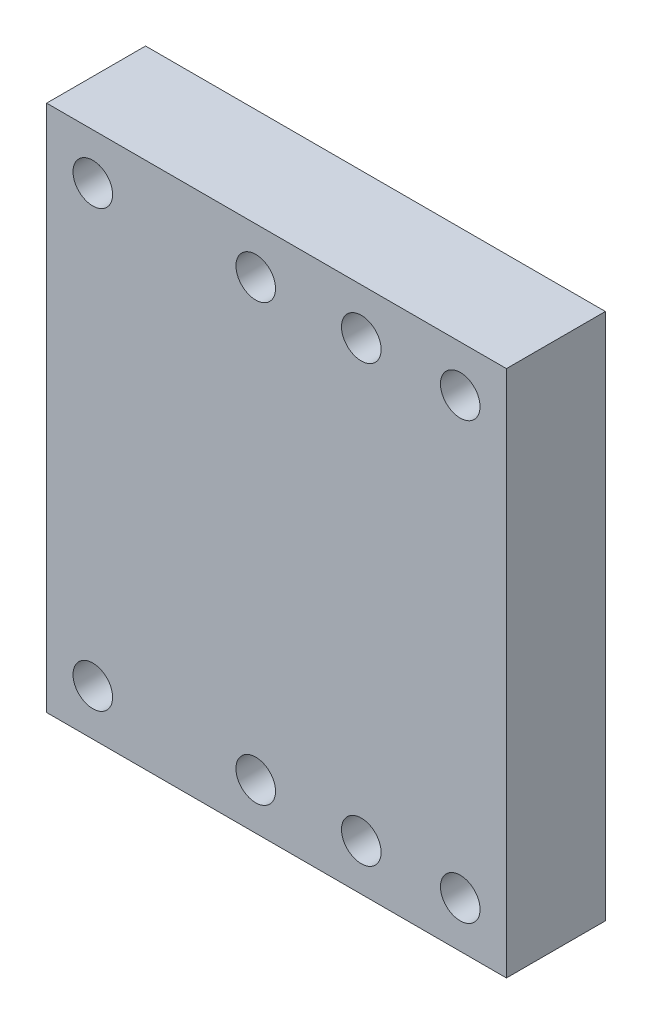
ISO-10303-21;
HEADER;
FILE_DESCRIPTION(('STEP AP214'),'2;1');
FILE_NAME('part.step','',(''),(''),'','','');
FILE_SCHEMA(('AUTOMOTIVE_DESIGN { 1 0 10303 214 1 1 1 1 }'));
ENDSEC;
DATA;
#1=APPLICATION_CONTEXT('core data for automotive mechanical design processes');
#2=APPLICATION_PROTOCOL_DEFINITION('international standard','automotive_design',2000,#1);
#3=PRODUCT_CONTEXT('',#1,'mechanical');
#4=PRODUCT('Part','Part','',(#3));
#5=PRODUCT_RELATED_PRODUCT_CATEGORY('part','',(#4));
#6=PRODUCT_DEFINITION_FORMATION('','',#4);
#7=PRODUCT_DEFINITION_CONTEXT('part definition',#1,'design');
#8=PRODUCT_DEFINITION('design','',#6,#7);
#9=PRODUCT_DEFINITION_SHAPE('','',#8);
#10=(LENGTH_UNIT() NAMED_UNIT(*) SI_UNIT(.MILLI.,.METRE.));
#11=(NAMED_UNIT(*) PLANE_ANGLE_UNIT() SI_UNIT($,.RADIAN.));
#12=(NAMED_UNIT(*) SI_UNIT($,.STERADIAN.) SOLID_ANGLE_UNIT());
#13=UNCERTAINTY_MEASURE_WITH_UNIT(LENGTH_MEASURE(1.E-05),#10,'distance_accuracy_value','');
#14=(GEOMETRIC_REPRESENTATION_CONTEXT(3) GLOBAL_UNCERTAINTY_ASSIGNED_CONTEXT((#13)) GLOBAL_UNIT_ASSIGNED_CONTEXT((#10,
#11,#12)) REPRESENTATION_CONTEXT('',''));
#15=CARTESIAN_POINT('',(0.,0.,0.));
#16=DIRECTION('',(0.,0.,1.));
#17=DIRECTION('',(1.,0.,0.));
#18=AXIS2_PLACEMENT_3D('',#15,#16,#17);
#19=CARTESIAN_POINT('',(-34.85,40.,15.));
#20=DIRECTION('',(1.,0.,0.));
#21=DIRECTION('',(0.,1.,0.));
#22=AXIS2_PLACEMENT_3D('',#19,#20,#21);
#23=PLANE('',#22);
#24=DIRECTION('',(0.,-1.,0.));
#25=VECTOR('',#24,1.);
#26=CARTESIAN_POINT('',(-34.85,40.,0.));
#27=LINE('',#26,#25);
#28=CARTESIAN_POINT('',(-34.85,40.,0.));
#29=VERTEX_POINT('',#28);
#30=CARTESIAN_POINT('',(-34.85,-40.,0.));
#31=VERTEX_POINT('',#30);
#32=EDGE_CURVE('E101',#29,#31,#27,.T.);
#33=ORIENTED_EDGE('',*,*,#32,.T.);
#34=DIRECTION('',(0.,0.,-1.));
#35=VECTOR('',#34,1.);
#36=CARTESIAN_POINT('',(-34.85,-40.,15.));
#37=LINE('',#36,#35);
#38=CARTESIAN_POINT('',(-34.85,-40.,15.));
#39=VERTEX_POINT('',#38);
#40=EDGE_CURVE('E11',#39,#31,#37,.T.);
#41=ORIENTED_EDGE('',*,*,#40,.F.);
#42=DIRECTION('',(0.,-1.,0.));
#43=VECTOR('',#42,1.);
#44=CARTESIAN_POINT('',(-34.85,40.,15.));
#45=LINE('',#44,#43);
#46=CARTESIAN_POINT('',(-34.85,40.,15.));
#47=VERTEX_POINT('',#46);
#48=EDGE_CURVE('E88',#47,#39,#45,.T.);
#49=ORIENTED_EDGE('',*,*,#48,.F.);
#50=DIRECTION('',(0.,0.,-1.));
#51=VECTOR('',#50,1.);
#52=CARTESIAN_POINT('',(-34.85,40.,15.));
#53=LINE('',#52,#51);
#54=EDGE_CURVE('E97',#47,#29,#53,.T.);
#55=ORIENTED_EDGE('',*,*,#54,.T.);
#56=EDGE_LOOP('',(#33,#41,#49,#55));
#57=FACE_BOUND('',#56,.T.);
#58=ADVANCED_FACE('F35',(#57),#23,.F.);
#59=CARTESIAN_POINT('',(-34.85,-40.,15.));
#60=DIRECTION('',(0.,1.,0.));
#61=DIRECTION('',(0.,0.,1.));
#62=AXIS2_PLACEMENT_3D('',#59,#60,#61);
#63=PLANE('',#62);
#64=DIRECTION('',(1.,0.,0.));
#65=VECTOR('',#64,1.);
#66=CARTESIAN_POINT('',(-34.85,-40.,0.));
#67=LINE('',#66,#65);
#68=CARTESIAN_POINT('',(34.85,-40.,0.));
#69=VERTEX_POINT('',#68);
#70=EDGE_CURVE('E92',#31,#69,#67,.T.);
#71=ORIENTED_EDGE('',*,*,#70,.T.);
#72=DIRECTION('',(0.,0.,-1.));
#73=VECTOR('',#72,1.);
#74=CARTESIAN_POINT('',(34.85,-40.,15.));
#75=LINE('',#74,#73);
#76=CARTESIAN_POINT('',(34.85,-40.,15.));
#77=VERTEX_POINT('',#76);
#78=EDGE_CURVE('E44',#77,#69,#75,.T.);
#79=ORIENTED_EDGE('',*,*,#78,.F.);
#80=DIRECTION('',(1.,0.,0.));
#81=VECTOR('',#80,1.);
#82=CARTESIAN_POINT('',(-34.85,-40.,15.));
#83=LINE('',#82,#81);
#84=EDGE_CURVE('E83',#39,#77,#83,.T.);
#85=ORIENTED_EDGE('',*,*,#84,.F.);
#86=ORIENTED_EDGE('',*,*,#40,.T.);
#87=EDGE_LOOP('',(#71,#79,#85,#86));
#88=FACE_BOUND('',#87,.T.);
#89=ADVANCED_FACE('F91',(#88),#63,.F.);
#90=CARTESIAN_POINT('',(34.85,-40.,15.));
#91=DIRECTION('',(-1.,0.,0.));
#92=DIRECTION('',(0.,-1.,0.));
#93=AXIS2_PLACEMENT_3D('',#90,#91,#92);
#94=PLANE('',#93);
#95=DIRECTION('',(0.,1.,0.));
#96=VECTOR('',#95,1.);
#97=CARTESIAN_POINT('',(34.85,-40.,0.));
#98=LINE('',#97,#96);
#99=CARTESIAN_POINT('',(34.85,40.,0.));
#100=VERTEX_POINT('',#99);
#101=EDGE_CURVE('E70',#69,#100,#98,.T.);
#102=ORIENTED_EDGE('',*,*,#101,.T.);
#103=DIRECTION('',(0.,0.,-1.));
#104=VECTOR('',#103,1.);
#105=CARTESIAN_POINT('',(34.85,40.,15.));
#106=LINE('',#105,#104);
#107=CARTESIAN_POINT('',(34.85,40.,15.));
#108=VERTEX_POINT('',#107);
#109=EDGE_CURVE('E93',#108,#100,#106,.T.);
#110=ORIENTED_EDGE('',*,*,#109,.F.);
#111=DIRECTION('',(0.,1.,0.));
#112=VECTOR('',#111,1.);
#113=CARTESIAN_POINT('',(34.85,-40.,15.));
#114=LINE('',#113,#112);
#115=EDGE_CURVE('E86',#77,#108,#114,.T.);
#116=ORIENTED_EDGE('',*,*,#115,.F.);
#117=ORIENTED_EDGE('',*,*,#78,.T.);
#118=EDGE_LOOP('',(#102,#110,#116,#117));
#119=FACE_BOUND('',#118,.T.);
#120=ADVANCED_FACE('F95',(#119),#94,.F.);
#121=CARTESIAN_POINT('',(34.85,40.,15.));
#122=DIRECTION('',(0.,-1.,0.));
#123=DIRECTION('',(1.,0.,0.));
#124=AXIS2_PLACEMENT_3D('',#121,#122,#123);
#125=PLANE('',#124);
#126=DIRECTION('',(-1.,0.,0.));
#127=VECTOR('',#126,1.);
#128=CARTESIAN_POINT('',(34.85,40.,0.));
#129=LINE('',#128,#127);
#130=EDGE_CURVE('E76',#100,#29,#129,.T.);
#131=ORIENTED_EDGE('',*,*,#130,.T.);
#132=ORIENTED_EDGE('',*,*,#54,.F.);
#133=DIRECTION('',(-1.,0.,0.));
#134=VECTOR('',#133,1.);
#135=CARTESIAN_POINT('',(34.85,40.,15.));
#136=LINE('',#135,#134);
#137=EDGE_CURVE('E53',#108,#47,#136,.T.);
#138=ORIENTED_EDGE('',*,*,#137,.F.);
#139=ORIENTED_EDGE('',*,*,#109,.T.);
#140=EDGE_LOOP('',(#131,#132,#138,#139));
#141=FACE_BOUND('',#140,.T.);
#142=ADVANCED_FACE('F202',(#141),#125,.F.);
#143=CARTESIAN_POINT('',(0.,0.,15.));
#144=DIRECTION('',(0.,0.,1.));
#145=DIRECTION('',(1.,0.,0.));
#146=AXIS2_PLACEMENT_3D('',#143,#144,#145);
#147=PLANE('',#146);
#148=CARTESIAN_POINT('',(-27.85,-33.,15.));
#149=DIRECTION('',(0.,0.,1.));
#150=DIRECTION('',(1.,0.,0.));
#151=AXIS2_PLACEMENT_3D('',#148,#149,#150);
#152=CIRCLE('',#151,3.);
#153=CARTESIAN_POINT('',(-24.85,-33.,15.));
#154=VERTEX_POINT('',#153);
#155=EDGE_CURVE('E171',#154,#154,#152,.T.);
#156=ORIENTED_EDGE('',*,*,#155,.F.);
#157=EDGE_LOOP('',(#156));
#158=FACE_BOUND('',#157,.T.);
#159=CARTESIAN_POINT('',(27.85,-33.,15.));
#160=DIRECTION('',(0.,0.,1.));
#161=DIRECTION('',(1.,0.,0.));
#162=AXIS2_PLACEMENT_3D('',#159,#160,#161);
#163=CIRCLE('',#162,3.);
#164=CARTESIAN_POINT('',(30.85,-33.,15.));
#165=VERTEX_POINT('',#164);
#166=EDGE_CURVE('E177',#165,#165,#163,.T.);
#167=ORIENTED_EDGE('',*,*,#166,.F.);
#168=EDGE_LOOP('',(#167));
#169=FACE_BOUND('',#168,.T.);
#170=CARTESIAN_POINT('',(27.85,33.,15.));
#171=DIRECTION('',(0.,0.,1.));
#172=DIRECTION('',(1.,0.,0.));
#173=AXIS2_PLACEMENT_3D('',#170,#171,#172);
#174=CIRCLE('',#173,3.);
#175=CARTESIAN_POINT('',(30.85,33.,15.));
#176=VERTEX_POINT('',#175);
#177=EDGE_CURVE('E183',#176,#176,#174,.T.);
#178=ORIENTED_EDGE('',*,*,#177,.F.);
#179=EDGE_LOOP('',(#178));
#180=FACE_BOUND('',#179,.T.);
#181=CARTESIAN_POINT('',(-27.85,33.,15.));
#182=DIRECTION('',(0.,0.,1.));
#183=DIRECTION('',(1.,0.,0.));
#184=AXIS2_PLACEMENT_3D('',#181,#182,#183);
#185=CIRCLE('',#184,3.);
#186=CARTESIAN_POINT('',(-24.85,33.,15.));
#187=VERTEX_POINT('',#186);
#188=EDGE_CURVE('E165',#187,#187,#185,.T.);
#189=ORIENTED_EDGE('',*,*,#188,.F.);
#190=EDGE_LOOP('',(#189));
#191=FACE_BOUND('',#190,.T.);
#192=CARTESIAN_POINT('',(12.85,33.,15.));
#193=DIRECTION('',(0.,0.,-1.));
#194=DIRECTION('',(-1.,0.,0.));
#195=AXIS2_PLACEMENT_3D('',#192,#193,#194);
#196=CIRCLE('',#195,2.99999999999999);
#197=CARTESIAN_POINT('',(9.85,33.,15.));
#198=VERTEX_POINT('',#197);
#199=EDGE_CURVE('E121',#198,#198,#196,.T.);
#200=ORIENTED_EDGE('',*,*,#199,.T.);
#201=EDGE_LOOP('',(#200));
#202=FACE_BOUND('',#201,.T.);
#203=CARTESIAN_POINT('',(-3.15000000000001,33.,15.));
#204=DIRECTION('',(0.,0.,-1.));
#205=DIRECTION('',(-1.,0.,0.));
#206=AXIS2_PLACEMENT_3D('',#203,#204,#205);
#207=CIRCLE('',#206,2.99999999999999);
#208=CARTESIAN_POINT('',(-6.15,33.,15.));
#209=VERTEX_POINT('',#208);
#210=EDGE_CURVE('E125',#209,#209,#207,.T.);
#211=ORIENTED_EDGE('',*,*,#210,.T.);
#212=EDGE_LOOP('',(#211));
#213=FACE_BOUND('',#212,.T.);
#214=CARTESIAN_POINT('',(-3.15000000000001,-33.,15.));
#215=DIRECTION('',(0.,0.,-1.));
#216=DIRECTION('',(-1.,0.,0.));
#217=AXIS2_PLACEMENT_3D('',#214,#215,#216);
#218=CIRCLE('',#217,3.00000000000001);
#219=CARTESIAN_POINT('',(-6.15000000000003,-33.,15.));
#220=VERTEX_POINT('',#219);
#221=EDGE_CURVE('E130',#220,#220,#218,.T.);
#222=ORIENTED_EDGE('',*,*,#221,.T.);
#223=EDGE_LOOP('',(#222));
#224=FACE_BOUND('',#223,.T.);
#225=CARTESIAN_POINT('',(12.85,-33.,15.));
#226=DIRECTION('',(0.,0.,-1.));
#227=DIRECTION('',(-1.,0.,0.));
#228=AXIS2_PLACEMENT_3D('',#225,#226,#227);
#229=CIRCLE('',#228,3.);
#230=CARTESIAN_POINT('',(9.84999999999998,-33.,15.));
#231=VERTEX_POINT('',#230);
#232=EDGE_CURVE('E104',#231,#231,#229,.T.);
#233=ORIENTED_EDGE('',*,*,#232,.T.);
#234=EDGE_LOOP('',(#233));
#235=FACE_BOUND('',#234,.T.);
#236=ORIENTED_EDGE('',*,*,#48,.T.);
#237=ORIENTED_EDGE('',*,*,#84,.T.);
#238=ORIENTED_EDGE('',*,*,#115,.T.);
#239=ORIENTED_EDGE('',*,*,#137,.T.);
#240=EDGE_LOOP('',(#236,#237,#238,#239));
#241=FACE_BOUND('',#240,.T.);
#242=ADVANCED_FACE('F84',(#158,#169,#180,#191,#202,#213,#224,#235,#241),#147,.T.);
#243=CARTESIAN_POINT('',(0.,0.,0.));
#244=DIRECTION('',(0.,0.,1.));
#245=DIRECTION('',(1.,0.,0.));
#246=AXIS2_PLACEMENT_3D('',#243,#244,#245);
#247=PLANE('',#246);
#248=CARTESIAN_POINT('',(-27.85,-33.,0.));
#249=DIRECTION('',(0.,0.,1.));
#250=DIRECTION('',(1.,0.,0.));
#251=AXIS2_PLACEMENT_3D('',#248,#249,#250);
#252=CIRCLE('',#251,3.);
#253=CARTESIAN_POINT('',(-24.85,-33.,0.));
#254=VERTEX_POINT('',#253);
#255=EDGE_CURVE('E174',#254,#254,#252,.T.);
#256=ORIENTED_EDGE('',*,*,#255,.T.);
#257=EDGE_LOOP('',(#256));
#258=FACE_BOUND('',#257,.T.);
#259=CARTESIAN_POINT('',(27.85,-33.,0.));
#260=DIRECTION('',(0.,0.,1.));
#261=DIRECTION('',(1.,0.,0.));
#262=AXIS2_PLACEMENT_3D('',#259,#260,#261);
#263=CIRCLE('',#262,3.);
#264=CARTESIAN_POINT('',(30.85,-33.,0.));
#265=VERTEX_POINT('',#264);
#266=EDGE_CURVE('E180',#265,#265,#263,.T.);
#267=ORIENTED_EDGE('',*,*,#266,.T.);
#268=EDGE_LOOP('',(#267));
#269=FACE_BOUND('',#268,.T.);
#270=CARTESIAN_POINT('',(27.85,33.,0.));
#271=DIRECTION('',(0.,0.,1.));
#272=DIRECTION('',(1.,0.,0.));
#273=AXIS2_PLACEMENT_3D('',#270,#271,#272);
#274=CIRCLE('',#273,3.);
#275=CARTESIAN_POINT('',(30.85,33.,0.));
#276=VERTEX_POINT('',#275);
#277=EDGE_CURVE('E168',#276,#276,#274,.T.);
#278=ORIENTED_EDGE('',*,*,#277,.T.);
#279=EDGE_LOOP('',(#278));
#280=FACE_BOUND('',#279,.T.);
#281=CARTESIAN_POINT('',(-27.85,33.,0.));
#282=DIRECTION('',(0.,0.,1.));
#283=DIRECTION('',(1.,0.,0.));
#284=AXIS2_PLACEMENT_3D('',#281,#282,#283);
#285=CIRCLE('',#284,3.);
#286=CARTESIAN_POINT('',(-24.85,33.,0.));
#287=VERTEX_POINT('',#286);
#288=EDGE_CURVE('E151',#287,#287,#285,.T.);
#289=ORIENTED_EDGE('',*,*,#288,.T.);
#290=EDGE_LOOP('',(#289));
#291=FACE_BOUND('',#290,.T.);
#292=CARTESIAN_POINT('',(-3.15000000000001,33.,0.));
#293=DIRECTION('',(0.,0.,1.));
#294=DIRECTION('',(1.,0.,0.));
#295=AXIS2_PLACEMENT_3D('',#292,#293,#294);
#296=CIRCLE('',#295,5.);
#297=CARTESIAN_POINT('',(1.84999999999998,33.,0.));
#298=VERTEX_POINT('',#297);
#299=EDGE_CURVE('E147',#298,#298,#296,.T.);
#300=ORIENTED_EDGE('',*,*,#299,.T.);
#301=EDGE_LOOP('',(#300));
#302=FACE_BOUND('',#301,.T.);
#303=CARTESIAN_POINT('',(12.85,33.,0.));
#304=DIRECTION('',(0.,0.,1.));
#305=DIRECTION('',(1.,0.,0.));
#306=AXIS2_PLACEMENT_3D('',#303,#304,#305);
#307=CIRCLE('',#306,5.);
#308=CARTESIAN_POINT('',(17.85,33.,0.));
#309=VERTEX_POINT('',#308);
#310=EDGE_CURVE('E154',#309,#309,#307,.T.);
#311=ORIENTED_EDGE('',*,*,#310,.T.);
#312=EDGE_LOOP('',(#311));
#313=FACE_BOUND('',#312,.T.);
#314=CARTESIAN_POINT('',(12.85,-33.,0.));
#315=DIRECTION('',(0.,0.,1.));
#316=DIRECTION('',(1.,0.,0.));
#317=AXIS2_PLACEMENT_3D('',#314,#315,#316);
#318=CIRCLE('',#317,5.);
#319=CARTESIAN_POINT('',(17.85,-33.,0.));
#320=VERTEX_POINT('',#319);
#321=EDGE_CURVE('E160',#320,#320,#318,.T.);
#322=ORIENTED_EDGE('',*,*,#321,.T.);
#323=EDGE_LOOP('',(#322));
#324=FACE_BOUND('',#323,.T.);
#325=CARTESIAN_POINT('',(-3.15000000000001,-33.,0.));
#326=DIRECTION('',(0.,0.,1.));
#327=DIRECTION('',(1.,0.,0.));
#328=AXIS2_PLACEMENT_3D('',#325,#326,#327);
#329=CIRCLE('',#328,5.);
#330=CARTESIAN_POINT('',(1.84999999999998,-33.,0.));
#331=VERTEX_POINT('',#330);
#332=EDGE_CURVE('E141',#331,#331,#329,.T.);
#333=ORIENTED_EDGE('',*,*,#332,.T.);
#334=EDGE_LOOP('',(#333));
#335=FACE_BOUND('',#334,.T.);
#336=ORIENTED_EDGE('',*,*,#32,.F.);
#337=ORIENTED_EDGE('',*,*,#130,.F.);
#338=ORIENTED_EDGE('',*,*,#101,.F.);
#339=ORIENTED_EDGE('',*,*,#70,.F.);
#340=EDGE_LOOP('',(#336,#337,#338,#339));
#341=FACE_BOUND('',#340,.T.);
#342=ADVANCED_FACE('F189',(#258,#269,#280,#291,#302,#313,#324,#335,#341),#247,.F.);
#343=CARTESIAN_POINT('',(12.85,-33.,15.));
#344=DIRECTION('',(0.,0.,-1.));
#345=DIRECTION('',(-1.,0.,0.));
#346=AXIS2_PLACEMENT_3D('',#343,#344,#345);
#347=CYLINDRICAL_SURFACE('',#346,3.);
#348=CARTESIAN_POINT('',(12.85,-33.,7.));
#349=DIRECTION('',(0.,0.,1.));
#350=DIRECTION('',(1.,0.,0.));
#351=AXIS2_PLACEMENT_3D('',#348,#349,#350);
#352=CIRCLE('',#351,3.);
#353=CARTESIAN_POINT('',(15.85,-33.,7.));
#354=VERTEX_POINT('',#353);
#355=EDGE_CURVE('E38',#354,#354,#352,.F.);
#356=ORIENTED_EDGE('',*,*,#355,.T.);
#357=EDGE_LOOP('',(#356));
#358=FACE_BOUND('',#357,.T.);
#359=ORIENTED_EDGE('',*,*,#232,.F.);
#360=EDGE_LOOP('',(#359));
#361=FACE_BOUND('',#360,.T.);
#362=ADVANCED_FACE('F222',(#358,#361),#347,.F.);
#363=CARTESIAN_POINT('',(-3.15000000000001,-33.,15.));
#364=DIRECTION('',(0.,0.,-1.));
#365=DIRECTION('',(-1.,0.,0.));
#366=AXIS2_PLACEMENT_3D('',#363,#364,#365);
#367=CYLINDRICAL_SURFACE('',#366,3.00000000000001);
#368=CARTESIAN_POINT('',(-3.15000000000001,-33.,7.));
#369=DIRECTION('',(0.,0.,1.));
#370=DIRECTION('',(1.,0.,0.));
#371=AXIS2_PLACEMENT_3D('',#368,#369,#370);
#372=CIRCLE('',#371,3.00000000000001);
#373=CARTESIAN_POINT('',(-0.15,-33.,7.));
#374=VERTEX_POINT('',#373);
#375=EDGE_CURVE('E116',#374,#374,#372,.F.);
#376=ORIENTED_EDGE('',*,*,#375,.T.);
#377=EDGE_LOOP('',(#376));
#378=FACE_BOUND('',#377,.T.);
#379=ORIENTED_EDGE('',*,*,#221,.F.);
#380=EDGE_LOOP('',(#379));
#381=FACE_BOUND('',#380,.T.);
#382=ADVANCED_FACE('F212',(#378,#381),#367,.F.);
#383=CARTESIAN_POINT('',(-3.15000000000001,33.,15.));
#384=DIRECTION('',(0.,0.,-1.));
#385=DIRECTION('',(-1.,0.,0.));
#386=AXIS2_PLACEMENT_3D('',#383,#384,#385);
#387=CYLINDRICAL_SURFACE('',#386,2.99999999999999);
#388=CARTESIAN_POINT('',(-3.15000000000001,33.,7.));
#389=DIRECTION('',(0.,0.,1.));
#390=DIRECTION('',(1.,0.,0.));
#391=AXIS2_PLACEMENT_3D('',#388,#389,#390);
#392=CIRCLE('',#391,2.99999999999999);
#393=CARTESIAN_POINT('',(-0.150000000000027,33.,7.));
#394=VERTEX_POINT('',#393);
#395=EDGE_CURVE('E113',#394,#394,#392,.F.);
#396=ORIENTED_EDGE('',*,*,#395,.T.);
#397=EDGE_LOOP('',(#396));
#398=FACE_BOUND('',#397,.T.);
#399=ORIENTED_EDGE('',*,*,#210,.F.);
#400=EDGE_LOOP('',(#399));
#401=FACE_BOUND('',#400,.T.);
#402=ADVANCED_FACE('F209',(#398,#401),#387,.F.);
#403=CARTESIAN_POINT('',(12.85,33.,15.));
#404=DIRECTION('',(0.,0.,-1.));
#405=DIRECTION('',(-1.,0.,0.));
#406=AXIS2_PLACEMENT_3D('',#403,#404,#405);
#407=CYLINDRICAL_SURFACE('',#406,2.99999999999999);
#408=CARTESIAN_POINT('',(12.85,33.,7.));
#409=DIRECTION('',(0.,0.,1.));
#410=DIRECTION('',(1.,0.,0.));
#411=AXIS2_PLACEMENT_3D('',#408,#409,#410);
#412=CIRCLE('',#411,2.99999999999999);
#413=CARTESIAN_POINT('',(15.85,33.,7.));
#414=VERTEX_POINT('',#413);
#415=EDGE_CURVE('E110',#414,#414,#412,.F.);
#416=ORIENTED_EDGE('',*,*,#415,.T.);
#417=EDGE_LOOP('',(#416));
#418=FACE_BOUND('',#417,.T.);
#419=ORIENTED_EDGE('',*,*,#199,.F.);
#420=EDGE_LOOP('',(#419));
#421=FACE_BOUND('',#420,.T.);
#422=ADVANCED_FACE('F211',(#418,#421),#407,.F.);
#423=CARTESIAN_POINT('',(12.85,33.,7.));
#424=DIRECTION('',(0.,0.,1.));
#425=DIRECTION('',(1.,0.,0.));
#426=AXIS2_PLACEMENT_3D('',#423,#424,#425);
#427=PLANE('',#426);
#428=CARTESIAN_POINT('',(12.85,33.,7.));
#429=DIRECTION('',(0.,0.,1.));
#430=DIRECTION('',(1.,0.,0.));
#431=AXIS2_PLACEMENT_3D('',#428,#429,#430);
#432=CIRCLE('',#431,5.);
#433=CARTESIAN_POINT('',(17.85,33.,7.));
#434=VERTEX_POINT('',#433);
#435=EDGE_CURVE('E157',#434,#434,#432,.T.);
#436=ORIENTED_EDGE('',*,*,#435,.F.);
#437=EDGE_LOOP('',(#436));
#438=FACE_BOUND('',#437,.T.);
#439=ORIENTED_EDGE('',*,*,#415,.F.);
#440=EDGE_LOOP('',(#439));
#441=FACE_BOUND('',#440,.T.);
#442=ADVANCED_FACE('F219',(#438,#441),#427,.F.);
#443=CARTESIAN_POINT('',(12.85,33.,7.));
#444=DIRECTION('',(0.,0.,-1.));
#445=DIRECTION('',(-1.,0.,0.));
#446=AXIS2_PLACEMENT_3D('',#443,#444,#445);
#447=CYLINDRICAL_SURFACE('',#446,5.);
#448=ORIENTED_EDGE('',*,*,#435,.T.);
#449=EDGE_LOOP('',(#448));
#450=FACE_BOUND('',#449,.T.);
#451=ORIENTED_EDGE('',*,*,#310,.F.);
#452=EDGE_LOOP('',(#451));
#453=FACE_BOUND('',#452,.T.);
#454=ADVANCED_FACE('F317',(#450,#453),#447,.F.);
#455=CARTESIAN_POINT('',(-3.15000000000001,33.,7.));
#456=DIRECTION('',(0.,0.,1.));
#457=DIRECTION('',(1.,0.,0.));
#458=AXIS2_PLACEMENT_3D('',#455,#456,#457);
#459=PLANE('',#458);
#460=CARTESIAN_POINT('',(-3.15000000000001,33.,7.));
#461=DIRECTION('',(0.,0.,1.));
#462=DIRECTION('',(1.,0.,0.));
#463=AXIS2_PLACEMENT_3D('',#460,#461,#462);
#464=CIRCLE('',#463,5.);
#465=CARTESIAN_POINT('',(1.84999999999998,33.,7.));
#466=VERTEX_POINT('',#465);
#467=EDGE_CURVE('E150',#466,#466,#464,.T.);
#468=ORIENTED_EDGE('',*,*,#467,.F.);
#469=EDGE_LOOP('',(#468));
#470=FACE_BOUND('',#469,.T.);
#471=ORIENTED_EDGE('',*,*,#395,.F.);
#472=EDGE_LOOP('',(#471));
#473=FACE_BOUND('',#472,.T.);
#474=ADVANCED_FACE('F321',(#470,#473),#459,.F.);
#475=CARTESIAN_POINT('',(-3.15000000000001,33.,7.));
#476=DIRECTION('',(0.,0.,-1.));
#477=DIRECTION('',(-1.,0.,0.));
#478=AXIS2_PLACEMENT_3D('',#475,#476,#477);
#479=CYLINDRICAL_SURFACE('',#478,5.);
#480=ORIENTED_EDGE('',*,*,#467,.T.);
#481=EDGE_LOOP('',(#480));
#482=FACE_BOUND('',#481,.T.);
#483=ORIENTED_EDGE('',*,*,#299,.F.);
#484=EDGE_LOOP('',(#483));
#485=FACE_BOUND('',#484,.T.);
#486=ADVANCED_FACE('F325',(#482,#485),#479,.F.);
#487=CARTESIAN_POINT('',(-3.15000000000001,-33.,7.));
#488=DIRECTION('',(0.,0.,1.));
#489=DIRECTION('',(1.,0.,0.));
#490=AXIS2_PLACEMENT_3D('',#487,#488,#489);
#491=PLANE('',#490);
#492=CARTESIAN_POINT('',(-3.15000000000001,-33.,7.));
#493=DIRECTION('',(0.,0.,1.));
#494=DIRECTION('',(1.,0.,0.));
#495=AXIS2_PLACEMENT_3D('',#492,#493,#494);
#496=CIRCLE('',#495,5.);
#497=CARTESIAN_POINT('',(1.84999999999998,-33.,7.));
#498=VERTEX_POINT('',#497);
#499=EDGE_CURVE('E114',#498,#498,#496,.T.);
#500=ORIENTED_EDGE('',*,*,#499,.F.);
#501=EDGE_LOOP('',(#500));
#502=FACE_BOUND('',#501,.T.);
#503=ORIENTED_EDGE('',*,*,#375,.F.);
#504=EDGE_LOOP('',(#503));
#505=FACE_BOUND('',#504,.T.);
#506=ADVANCED_FACE('F329',(#502,#505),#491,.F.);
#507=CARTESIAN_POINT('',(-3.15000000000001,-33.,7.));
#508=DIRECTION('',(0.,0.,-1.));
#509=DIRECTION('',(-1.,0.,0.));
#510=AXIS2_PLACEMENT_3D('',#507,#508,#509);
#511=CYLINDRICAL_SURFACE('',#510,5.);
#512=ORIENTED_EDGE('',*,*,#499,.T.);
#513=EDGE_LOOP('',(#512));
#514=FACE_BOUND('',#513,.T.);
#515=ORIENTED_EDGE('',*,*,#332,.F.);
#516=EDGE_LOOP('',(#515));
#517=FACE_BOUND('',#516,.T.);
#518=ADVANCED_FACE('F311',(#514,#517),#511,.F.);
#519=CARTESIAN_POINT('',(12.85,-33.,7.));
#520=DIRECTION('',(0.,0.,1.));
#521=DIRECTION('',(1.,0.,0.));
#522=AXIS2_PLACEMENT_3D('',#519,#520,#521);
#523=PLANE('',#522);
#524=CARTESIAN_POINT('',(12.85,-33.,7.));
#525=DIRECTION('',(0.,0.,1.));
#526=DIRECTION('',(1.,0.,0.));
#527=AXIS2_PLACEMENT_3D('',#524,#525,#526);
#528=CIRCLE('',#527,5.);
#529=CARTESIAN_POINT('',(17.85,-33.,7.));
#530=VERTEX_POINT('',#529);
#531=EDGE_CURVE('E144',#530,#530,#528,.T.);
#532=ORIENTED_EDGE('',*,*,#531,.F.);
#533=EDGE_LOOP('',(#532));
#534=FACE_BOUND('',#533,.T.);
#535=ORIENTED_EDGE('',*,*,#355,.F.);
#536=EDGE_LOOP('',(#535));
#537=FACE_BOUND('',#536,.T.);
#538=ADVANCED_FACE('F308',(#534,#537),#523,.F.);
#539=CARTESIAN_POINT('',(12.85,-33.,7.));
#540=DIRECTION('',(0.,0.,-1.));
#541=DIRECTION('',(-1.,0.,0.));
#542=AXIS2_PLACEMENT_3D('',#539,#540,#541);
#543=CYLINDRICAL_SURFACE('',#542,5.);
#544=ORIENTED_EDGE('',*,*,#531,.T.);
#545=EDGE_LOOP('',(#544));
#546=FACE_BOUND('',#545,.T.);
#547=ORIENTED_EDGE('',*,*,#321,.F.);
#548=EDGE_LOOP('',(#547));
#549=FACE_BOUND('',#548,.T.);
#550=ADVANCED_FACE('F262',(#546,#549),#543,.F.);
#551=CARTESIAN_POINT('',(-27.85,33.,0.));
#552=DIRECTION('',(0.,0.,1.));
#553=DIRECTION('',(1.,0.,0.));
#554=AXIS2_PLACEMENT_3D('',#551,#552,#553);
#555=CYLINDRICAL_SURFACE('',#554,3.);
#556=ORIENTED_EDGE('',*,*,#288,.F.);
#557=EDGE_LOOP('',(#556));
#558=FACE_BOUND('',#557,.T.);
#559=ORIENTED_EDGE('',*,*,#188,.T.);
#560=EDGE_LOOP('',(#559));
#561=FACE_BOUND('',#560,.T.);
#562=ADVANCED_FACE('F196',(#558,#561),#555,.F.);
#563=CARTESIAN_POINT('',(27.85,33.,0.));
#564=DIRECTION('',(0.,0.,1.));
#565=DIRECTION('',(1.,0.,0.));
#566=AXIS2_PLACEMENT_3D('',#563,#564,#565);
#567=CYLINDRICAL_SURFACE('',#566,3.);
#568=ORIENTED_EDGE('',*,*,#277,.F.);
#569=EDGE_LOOP('',(#568));
#570=FACE_BOUND('',#569,.T.);
#571=ORIENTED_EDGE('',*,*,#177,.T.);
#572=EDGE_LOOP('',(#571));
#573=FACE_BOUND('',#572,.T.);
#574=ADVANCED_FACE('F192',(#570,#573),#567,.F.);
#575=CARTESIAN_POINT('',(27.85,-33.,0.));
#576=DIRECTION('',(0.,0.,1.));
#577=DIRECTION('',(1.,0.,0.));
#578=AXIS2_PLACEMENT_3D('',#575,#576,#577);
#579=CYLINDRICAL_SURFACE('',#578,3.);
#580=ORIENTED_EDGE('',*,*,#266,.F.);
#581=EDGE_LOOP('',(#580));
#582=FACE_BOUND('',#581,.T.);
#583=ORIENTED_EDGE('',*,*,#166,.T.);
#584=EDGE_LOOP('',(#583));
#585=FACE_BOUND('',#584,.T.);
#586=ADVANCED_FACE('F195',(#582,#585),#579,.F.);
#587=CARTESIAN_POINT('',(-27.85,-33.,0.));
#588=DIRECTION('',(0.,0.,1.));
#589=DIRECTION('',(1.,0.,0.));
#590=AXIS2_PLACEMENT_3D('',#587,#588,#589);
#591=CYLINDRICAL_SURFACE('',#590,3.);
#592=ORIENTED_EDGE('',*,*,#255,.F.);
#593=EDGE_LOOP('',(#592));
#594=FACE_BOUND('',#593,.T.);
#595=ORIENTED_EDGE('',*,*,#155,.T.);
#596=EDGE_LOOP('',(#595));
#597=FACE_BOUND('',#596,.T.);
#598=ADVANCED_FACE('F291',(#594,#597),#591,.F.);
#599=CLOSED_SHELL('',(#58,#89,#120,#142,#242,#342,#362,#382,#402,#422,#442,#454,#474,#486,#506,
#518,#538,#550,#562,#574,#586,#598));
#600=MANIFOLD_SOLID_BREP('B2',#599);
#601=ADVANCED_BREP_SHAPE_REPRESENTATION('',(#18,#600),#14);
#602=SHAPE_DEFINITION_REPRESENTATION(#9,#601);
ENDSEC;
END-ISO-10303-21;
